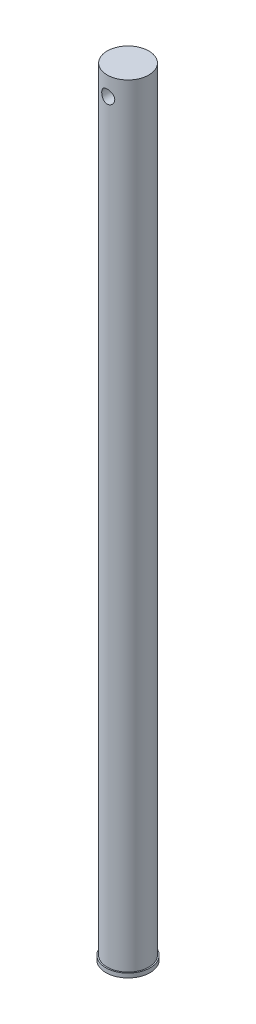
ISO-10303-21;
HEADER;
FILE_DESCRIPTION(('STEP AP214'),'2;1');
FILE_NAME('part.step','',(''),(''),'','','');
FILE_SCHEMA(('AUTOMOTIVE_DESIGN { 1 0 10303 214 1 1 1 1 }'));
ENDSEC;
DATA;
#1=APPLICATION_CONTEXT('core data for automotive mechanical design processes');
#2=APPLICATION_PROTOCOL_DEFINITION('international standard','automotive_design',2000,#1);
#3=PRODUCT_CONTEXT('',#1,'mechanical');
#4=PRODUCT('Part','Part','',(#3));
#5=PRODUCT_RELATED_PRODUCT_CATEGORY('part','',(#4));
#6=PRODUCT_DEFINITION_FORMATION('','',#4);
#7=PRODUCT_DEFINITION_CONTEXT('part definition',#1,'design');
#8=PRODUCT_DEFINITION('design','',#6,#7);
#9=PRODUCT_DEFINITION_SHAPE('','',#8);
#10=(LENGTH_UNIT() NAMED_UNIT(*) SI_UNIT(.MILLI.,.METRE.));
#11=(NAMED_UNIT(*) PLANE_ANGLE_UNIT() SI_UNIT($,.RADIAN.));
#12=(NAMED_UNIT(*) SI_UNIT($,.STERADIAN.) SOLID_ANGLE_UNIT());
#13=UNCERTAINTY_MEASURE_WITH_UNIT(LENGTH_MEASURE(1.E-05),#10,'distance_accuracy_value','');
#14=(GEOMETRIC_REPRESENTATION_CONTEXT(3) GLOBAL_UNCERTAINTY_ASSIGNED_CONTEXT((#13)) GLOBAL_UNIT_ASSIGNED_CONTEXT((#10,
#11,#12)) REPRESENTATION_CONTEXT('',''));
#15=CARTESIAN_POINT('',(0.,0.,0.));
#16=DIRECTION('',(0.,0.,1.));
#17=DIRECTION('',(1.,0.,0.));
#18=AXIS2_PLACEMENT_3D('',#15,#16,#17);
#19=CARTESIAN_POINT('',(0.,367.538,0.));
#20=DIRECTION('',(0.,-1.,0.));
#21=DIRECTION('',(0.,0.,-1.));
#22=AXIS2_PLACEMENT_3D('',#19,#20,#21);
#23=CYLINDRICAL_SURFACE('',#22,9.906);
#24=CARTESIAN_POINT('',(0.,361.748,-9.906));
#25=CARTESIAN_POINT('',(-0.169717162799785,361.747998928521,-9.90599917780914));
#26=CARTESIAN_POINT('',(-0.339445602881006,361.734016708203,-9.90159726380384));
#27=CARTESIAN_POINT('',(-0.673938184699608,361.678604361084,-9.88446847232185));
#28=CARTESIAN_POINT('',(-0.838701206873449,361.637168091857,-9.87173973185215));
#29=CARTESIAN_POINT('',(-1.15839117477005,361.528382322282,-9.8393476559066));
#30=CARTESIAN_POINT('',(-1.31333293906974,361.461072999036,-9.81969507607885));
#31=CARTESIAN_POINT('',(-1.60973071027066,361.302622942269,-9.77548399720062));
#32=CARTESIAN_POINT('',(-1.75118457571855,361.211478433041,-9.75092472103094));
#33=CARTESIAN_POINT('',(-2.02097162955031,361.004974735729,-9.69865617210438));
#34=CARTESIAN_POINT('',(-2.14882860602327,360.889010873208,-9.67087812858727));
#35=CARTESIAN_POINT('',(-2.38363432809621,360.637447701663,-9.61570072207861));
#36=CARTESIAN_POINT('',(-2.49057916723258,360.501844732203,-9.58830143072601));
#37=CARTESIAN_POINT('',(-2.68310983564701,360.210726617432,-9.53624545355769));
#38=CARTESIAN_POINT('',(-2.76810025964437,360.05480108777,-9.51167362471039));
#39=CARTESIAN_POINT('',(-2.91045450147599,359.729976892709,-9.46908926440421));
#40=CARTESIAN_POINT('',(-2.96782562015835,359.561081669404,-9.45107499983544));
#41=CARTESIAN_POINT('',(-3.05156927208296,359.220486972408,-9.42436485613363));
#42=CARTESIAN_POINT('',(-3.07882536464526,359.049026097248,-9.41540407315736));
#43=CARTESIAN_POINT('',(-3.10432565541955,358.703748980991,-9.40702901755102));
#44=CARTESIAN_POINT('',(-3.10257759151761,358.529933380465,-9.4076121987299));
#45=CARTESIAN_POINT('',(-3.07081015053398,358.19219425638,-9.41802538616976));
#46=CARTESIAN_POINT('',(-3.04191458025059,358.028151785231,-9.42748780592657));
#47=CARTESIAN_POINT('',(-2.95849469232745,357.707371184059,-9.45399605058147));
#48=CARTESIAN_POINT('',(-2.90396764388742,357.550633834288,-9.47104268349795));
#49=CARTESIAN_POINT('',(-2.77004018758997,357.24623808083,-9.51107994166389));
#50=CARTESIAN_POINT('',(-2.69028731147665,357.098746191673,-9.53415393547644));
#51=CARTESIAN_POINT('',(-2.50841687891653,356.81887035634,-9.58360792970439));
#52=CARTESIAN_POINT('',(-2.40629349907738,356.686490357701,-9.60998879018264));
#53=CARTESIAN_POINT('',(-2.17706883064353,356.434243548478,-9.66455812398114));
#54=CARTESIAN_POINT('',(-2.04903998838251,356.315224037859,-9.69277413419145));
#55=CARTESIAN_POINT('',(-1.77448919651215,356.100138240246,-9.74677237723143));
#56=CARTESIAN_POINT('',(-1.62796587032697,356.004073663368,-9.77255442864749));
#57=CARTESIAN_POINT('',(-1.31894908072523,355.837048340235,-9.81905186663502));
#58=CARTESIAN_POINT('',(-1.15633947473291,355.766290201446,-9.83972596871358));
#59=CARTESIAN_POINT('',(-0.82072791831902,355.653384030081,-9.87338004125529));
#60=CARTESIAN_POINT('',(-0.647729150269809,355.611227284593,-9.88636235473395));
#61=CARTESIAN_POINT('',(-0.30344177330455,355.558165110155,-9.90279284682759));
#62=CARTESIAN_POINT('',(-0.132346374575684,355.54611268681,-9.90659076818545));
#63=CARTESIAN_POINT('',(0.20944084011115,355.550366650584,-9.90525923243826));
#64=CARTESIAN_POINT('',(0.380132711539446,355.566668881988,-9.90013108355573));
#65=CARTESIAN_POINT('',(0.711839988772254,355.626248861863,-9.88175344716667));
#66=CARTESIAN_POINT('',(0.872990555994629,355.668843669241,-9.86870970511422));
#67=CARTESIAN_POINT('',(1.18581229079732,355.778965940508,-9.83602766555473));
#68=CARTESIAN_POINT('',(1.33748228394459,355.846496486253,-9.81638855294017));
#69=CARTESIAN_POINT('',(1.63115765498441,356.006416763732,-9.7719379374185));
#70=CARTESIAN_POINT('',(1.7728365343979,356.099373339206,-9.74701182583495));
#71=CARTESIAN_POINT('',(2.03896896423261,356.306827191617,-9.69483692523251));
#72=CARTESIAN_POINT('',(2.16341781434166,356.421330326387,-9.6675875056835));
#73=CARTESIAN_POINT('',(2.39669199999797,356.67402177774,-9.61247385111985));
#74=CARTESIAN_POINT('',(2.5046998148026,356.812970571936,-9.58462822380061));
#75=CARTESIAN_POINT('',(2.69593943471906,357.107625541636,-9.53260733471032));
#76=CARTESIAN_POINT('',(2.77917162296442,357.263331457954,-9.50843201618396));
#77=CARTESIAN_POINT('',(2.91798226854083,357.586766234941,-9.46675655616247));
#78=CARTESIAN_POINT('',(2.97366691510897,357.754446031107,-9.44923084390955));
#79=CARTESIAN_POINT('',(3.05581082196463,358.097463169225,-9.42299059899169));
#80=CARTESIAN_POINT('',(3.082281243914,358.272797560008,-9.4142727012982));
#81=CARTESIAN_POINT('',(3.10444234179799,358.617598534337,-9.4069864608542));
#82=CARTESIAN_POINT('',(3.10147447065118,358.786970615291,-9.40797575495465));
#83=CARTESIAN_POINT('',(3.0680828409094,359.122676335019,-9.41891741890776));
#84=CARTESIAN_POINT('',(3.03766036989651,359.289010115913,-9.42886936842445));
#85=CARTESIAN_POINT('',(2.95112218438558,359.611511377863,-9.45630547546242));
#86=CARTESIAN_POINT('',(2.89539137071711,359.767792486601,-9.47367657178612));
#87=CARTESIAN_POINT('',(2.76012176437793,360.068910405187,-9.51396454523457));
#88=CARTESIAN_POINT('',(2.68057811896827,360.21374487475,-9.53688255256365));
#89=CARTESIAN_POINT('',(2.49629259737634,360.494007044435,-9.58680341671116));
#90=CARTESIAN_POINT('',(2.39068484969565,360.628843078489,-9.61393122281513));
#91=CARTESIAN_POINT('',(2.15879132227147,360.879313918376,-9.66864149322035));
#92=CARTESIAN_POINT('',(2.0325000053632,360.994943565757,-9.69622407748638));
#93=CARTESIAN_POINT('',(1.75784363750034,361.207513996653,-9.74982069815159));
#94=CARTESIAN_POINT('',(1.60889072857392,361.303717941243,-9.77575368305722));
#95=CARTESIAN_POINT('',(1.29611556678029,361.469593300998,-9.82211054959393));
#96=CARTESIAN_POINT('',(1.13229914953051,361.53927507379,-9.8425365809285));
#97=CARTESIAN_POINT('',(0.808610538577713,361.645110895093,-9.87416733455605));
#98=CARTESIAN_POINT('',(0.649555710285697,361.683582905434,-9.88600074487395));
#99=CARTESIAN_POINT('',(0.327003469087308,361.735025376508,-9.90191668416884));
#100=CARTESIAN_POINT('',(0.163506968082212,361.748001032272,-9.90600079210571));
#101=CARTESIAN_POINT('',(0.,361.748,-9.906));
#102=B_SPLINE_CURVE_WITH_KNOTS('',3,(#24,#25,#26,#27,#28,#29,#30,#31,#32,#33,#34,#35,#36,#37,
#38,#39,#40,#41,#42,#43,#44,#45,#46,#47,#48,#49,#50,#51,#52,#53,#54,#55,#56,#57,#58,#59,#60,#61,
#62,#63,#64,#65,#66,#67,#68,#69,#70,#71,#72,#73,#74,#75,#76,#77,#78,#79,#80,#81,#82,#83,#84,#85,
#86,#87,#88,#89,#90,#91,#92,#93,#94,#95,#96,#97,#98,#99,#100,#101),.UNSPECIFIED.,.T.,.F.,(4,2,2,
2,2,2,2,2,2,2,2,2,2,2,2,2,2,2,2,2,2,2,2,2,2,2,2,2,2,2,2,2,2,2,2,2,2,2,4),(0.,0.508550475560675,
1.01721477001258,1.5250923528379,2.03305043682327,2.55518141955897,3.07740984528613,
3.61258809604515,4.14762480075796,4.66650870588334,5.18525418257435,5.68342955582766,
6.18165801715831,6.68718073654229,7.19283520811967,7.72157698449076,8.25035813924252,
8.78328272787472,9.31604489740507,9.82817572821973,10.3402315064463,10.839516030322,
11.3388622824106,11.8504038053384,12.3620846018047,12.8941016834876,13.4261105375612,
13.9560523257757,14.4857915728997,14.9915065645921,15.497197840196,15.9954433547896,
16.4937904744019,17.0116814955932,17.5297113878594,18.0647217207769,18.5995229027869,
19.0895646453484,19.5795065286792),.UNSPECIFIED.);
#103=CARTESIAN_POINT('',(0.,361.748,-9.906));
#104=VERTEX_POINT('',#103);
#105=EDGE_CURVE('E36',#104,#104,#102,.T.);
#106=ORIENTED_EDGE('',*,*,#105,.T.);
#107=EDGE_LOOP('',(#106));
#108=FACE_BOUND('',#107,.T.);
#109=CARTESIAN_POINT('',(3.09999999999999,358.648,9.40844492995522));
#110=CARTESIAN_POINT('',(3.09999889052878,358.478512649003,9.40844594629458));
#111=CARTESIAN_POINT('',(3.08605315405969,358.309013986756,9.413074851886));
#112=CARTESIAN_POINT('',(3.03079885916146,357.974997151281,9.43100818327891));
#113=CARTESIAN_POINT('',(2.98948296796968,357.810480325095,9.44431493395474));
#114=CARTESIAN_POINT('',(2.88104876358965,357.491313756269,9.47795240643352));
#115=CARTESIAN_POINT('',(2.81397620809861,357.336647079344,9.49827066557167));
#116=CARTESIAN_POINT('',(2.65608537410762,357.04071860095,9.54362446814132));
#117=CARTESIAN_POINT('',(2.56526287818102,356.899459186371,9.56866084917869));
#118=CARTESIAN_POINT('',(2.35909954896564,356.629488671875,9.62159729631544));
#119=CARTESIAN_POINT('',(2.2430814293739,356.501307408258,9.64956238795848));
#120=CARTESIAN_POINT('',(1.99126936719257,356.265865664927,9.70465207107307));
#121=CARTESIAN_POINT('',(1.85547265975446,356.15860811505,9.73177654439061));
#122=CARTESIAN_POINT('',(1.56414935026077,355.965719032576,9.78287279171415));
#123=CARTESIAN_POINT('',(1.40824502488887,355.880633346134,9.80675907760499));
#124=CARTESIAN_POINT('',(1.08346419328968,355.738097488024,9.84792812930078));
#125=CARTESIAN_POINT('',(0.914590756117409,355.680640801362,9.86521245166899));
#126=CARTESIAN_POINT('',(0.574213196546782,355.596763583688,9.89076983177562));
#127=CARTESIAN_POINT('',(0.402952301431719,355.569437430651,9.89930525773119));
#128=CARTESIAN_POINT('',(0.0580779813902911,355.543727371389,9.90732987018807));
#129=CARTESIAN_POINT('',(-0.115534898275763,355.545336867983,9.90682111871642));
#130=CARTESIAN_POINT('',(-0.453810324719841,355.576857108525,9.89699728375633));
#131=CARTESIAN_POINT('',(-0.618574642999552,355.605786076151,9.88798770331893));
#132=CARTESIAN_POINT('',(-0.940780072890124,355.689512892221,9.86255043808704));
#133=CARTESIAN_POINT('',(-1.09822070571038,355.744312429367,9.84612226904726));
#134=CARTESIAN_POINT('',(-1.40357238805535,355.878854449621,9.8072840360243));
#135=CARTESIAN_POINT('',(-1.5513429467276,355.958894485245,9.78480310593874));
#136=CARTESIAN_POINT('',(-1.83166059809276,356.141406618206,9.73622737490145));
#137=CARTESIAN_POINT('',(-1.96420381981552,356.24388440033,9.71013165873054));
#138=CARTESIAN_POINT('',(-2.21615822096116,356.473401650207,9.6558164588839));
#139=CARTESIAN_POINT('',(-2.33478921891057,356.601288529926,9.62755379643933));
#140=CARTESIAN_POINT('',(-2.54915377127928,356.875405136561,9.57303069668153));
#141=CARTESIAN_POINT('',(-2.64488461277116,357.021637033643,9.5467704968461));
#142=CARTESIAN_POINT('',(-2.81164262012195,357.330502556123,9.49900741424247));
#143=CARTESIAN_POINT('',(-2.88238000965628,357.493302068515,9.47756132387884));
#144=CARTESIAN_POINT('',(-2.99519081690978,357.829335015855,9.44252073589027));
#145=CARTESIAN_POINT('',(-3.03727456787157,358.002564664869,9.42892340806826));
#146=CARTESIAN_POINT('',(-3.09007660987781,358.347064111396,9.41174835324044));
#147=CARTESIAN_POINT('',(-3.10198991141381,358.518131837638,9.40778913325687));
#148=CARTESIAN_POINT('',(-3.09746825734678,358.859834111294,9.40927924660996));
#149=CARTESIAN_POINT('',(-3.08103769723874,359.030468721765,9.41472712111812));
#150=CARTESIAN_POINT('',(-3.02136281103057,359.361310252523,9.43404086805172));
#151=CARTESIAN_POINT('',(-2.9789105802225,359.521676084978,9.4476578236185));
#152=CARTESIAN_POINT('',(-2.8693278239122,359.832990369841,9.48151150827996));
#153=CARTESIAN_POINT('',(-2.80219326591974,359.983937278712,9.50174931900133));
#154=CARTESIAN_POINT('',(-2.64294963471786,360.276930559457,9.54728653051085));
#155=CARTESIAN_POINT('',(-2.55017817905427,360.418596393684,9.57271469762291));
#156=CARTESIAN_POINT('',(-2.34306701113802,360.684784794988,9.62550124813057));
#157=CARTESIAN_POINT('',(-2.2287216802669,360.809302881524,9.65286013319055));
#158=CARTESIAN_POINT('',(-1.97605333066839,361.043002133028,9.70780194685249));
#159=CARTESIAN_POINT('',(-1.83693102806775,361.151330340391,9.73534689293917));
#160=CARTESIAN_POINT('',(-1.5418164000877,361.343137300903,9.78642069667665));
#161=CARTESIAN_POINT('',(-1.38582484507855,361.42661718815,9.80994973759587));
#162=CARTESIAN_POINT('',(-1.0623570894053,361.565557586632,9.8502066984653));
#163=CARTESIAN_POINT('',(-0.894974294888868,361.621220632323,9.86698360102458));
#164=CARTESIAN_POINT('',(-0.552605174122446,361.703420482801,9.8920613585434));
#165=CARTESIAN_POINT('',(-0.377621252607967,361.729966430468,9.90036487412204));
#166=CARTESIAN_POINT('',(-0.0328676101127206,361.752434156943,9.90738348897342));
#167=CARTESIAN_POINT('',(0.136814923660559,361.749587837008,9.90648431004359));
#168=CARTESIAN_POINT('',(0.473174918837302,361.716332129456,9.89612300296258));
#169=CARTESIAN_POINT('',(0.639852576383446,361.685924547586,9.88666143579872));
#170=CARTESIAN_POINT('',(0.963411659231982,361.599194583944,9.86036090295072));
#171=CARTESIAN_POINT('',(1.12038990133997,361.543202822637,9.84361618523123));
#172=CARTESIAN_POINT('',(1.42279928653792,361.407192702889,9.80447615901159));
#173=CARTESIAN_POINT('',(1.56822844095729,361.327170217823,9.7820798801146));
#174=CARTESIAN_POINT('',(1.84878953226194,361.142225161518,9.73302596045813));
#175=CARTESIAN_POINT('',(1.98340354878734,361.036548783672,9.70624936435452));
#176=CARTESIAN_POINT('',(2.23339646422936,360.80462422267,9.6517965512273));
#177=CARTESIAN_POINT('',(2.34876957908856,360.678369875988,9.62412006666294));
#178=CARTESIAN_POINT('',(2.56087759615326,360.403841462769,9.56990825001818));
#179=CARTESIAN_POINT('',(2.65686516120167,360.254974789274,9.54344146663922));
#180=CARTESIAN_POINT('',(2.82235629991737,359.942426975596,9.49581997395171));
#181=CARTESIAN_POINT('',(2.89187051050082,359.778751818202,9.47466313229172));
#182=CARTESIAN_POINT('',(2.9974111452724,359.455439331853,9.44177753886595));
#183=CARTESIAN_POINT('',(3.03576870409443,359.296627062409,9.42940378021031));
#184=CARTESIAN_POINT('',(3.08706051138345,358.974545950442,9.41273798896532));
#185=CARTESIAN_POINT('',(3.10000106882599,358.811278224052,9.4084439508492));
#186=CARTESIAN_POINT('',(3.09999999999999,358.648,9.40844492995522));
#187=B_SPLINE_CURVE_WITH_KNOTS('',3,(#109,#110,#111,#112,#113,#114,#115,#116,#117,#118,#119,
#120,#121,#122,#123,#124,#125,#126,#127,#128,#129,#130,#131,#132,#133,#134,#135,#136,#137,#138,
#139,#140,#141,#142,#143,#144,#145,#146,#147,#148,#149,#150,#151,#152,#153,#154,#155,#156,#157,
#158,#159,#160,#161,#162,#163,#164,#165,#166,#167,#168,#169,#170,#171,#172,#173,#174,#175,#176,
#177,#178,#179,#180,#181,#182,#183,#184,#185,#186),.UNSPECIFIED.,.T.,.F.,(4,2,2,2,2,2,2,2,2,2,2,
2,2,2,2,2,2,2,2,2,2,2,2,2,2,2,2,2,2,2,2,2,2,2,2,2,2,2,4),(0.,0.50785888032799,1.01585387663794,
1.52295054459032,2.03013732211628,2.55316782144827,3.07627150550557,3.61124306484487,
4.1460884144837,4.66437853110558,5.18255048169877,5.68278226002893,6.18304669550126,
6.68944413524563,7.1959700237164,7.72366194270671,8.25141634518616,8.78510295486944,
9.31859700128562,9.83060401012894,10.342531625347,10.8396008402273,11.3367513002065,
11.8481914465745,12.3597649748018,12.8926091237186,13.4254289494427,13.9543106343076,
14.4830262007008,14.9896750864258,15.496290780123,15.9965370444811,16.496869261743,
17.0142053096812,17.531696596114,18.0663957344074,18.600879804918,19.0902548889058,
19.579508485478),.UNSPECIFIED.);
#188=CARTESIAN_POINT('',(3.09999999999999,358.648,9.40844492995522));
#189=VERTEX_POINT('',#188);
#190=EDGE_CURVE('E48',#189,#189,#187,.T.);
#191=ORIENTED_EDGE('',*,*,#190,.T.);
#192=EDGE_LOOP('',(#191));
#193=FACE_BOUND('',#192,.T.);
#194=CARTESIAN_POINT('',(0.,367.538,0.));
#195=DIRECTION('',(0.,1.,0.));
#196=DIRECTION('',(0.,0.,1.));
#197=AXIS2_PLACEMENT_3D('',#194,#195,#196);
#198=CIRCLE('',#197,9.906);
#199=CARTESIAN_POINT('',(0.,367.538,9.906));
#200=VERTEX_POINT('',#199);
#201=EDGE_CURVE('E10',#200,#200,#198,.T.);
#202=ORIENTED_EDGE('',*,*,#201,.F.);
#203=EDGE_LOOP('',(#202));
#204=FACE_BOUND('',#203,.T.);
#205=CARTESIAN_POINT('',(0.,0.,0.));
#206=DIRECTION('',(0.,-1.,0.));
#207=DIRECTION('',(0.,0.,-1.));
#208=AXIS2_PLACEMENT_3D('',#205,#206,#207);
#209=CIRCLE('',#208,9.906);
#210=CARTESIAN_POINT('',(0.,0.,-9.906));
#211=VERTEX_POINT('',#210);
#212=EDGE_CURVE('E50',#211,#211,#209,.T.);
#213=ORIENTED_EDGE('',*,*,#212,.F.);
#214=EDGE_LOOP('',(#213));
#215=FACE_BOUND('',#214,.T.);
#216=ADVANCED_FACE('F32',(#108,#193,#204,#215),#23,.T.);
#217=CARTESIAN_POINT('',(0.,367.538,0.));
#218=DIRECTION('',(0.,1.,0.));
#219=DIRECTION('',(0.,0.,1.));
#220=AXIS2_PLACEMENT_3D('',#217,#218,#219);
#221=PLANE('',#220);
#222=ORIENTED_EDGE('',*,*,#201,.T.);
#223=EDGE_LOOP('',(#222));
#224=FACE_BOUND('',#223,.T.);
#225=ADVANCED_FACE('F61',(#224),#221,.T.);
#226=CARTESIAN_POINT('',(0.,358.648,-10.));
#227=DIRECTION('',(0.,0.,1.));
#228=DIRECTION('',(1.,0.,0.));
#229=AXIS2_PLACEMENT_3D('',#226,#227,#228);
#230=CYLINDRICAL_SURFACE('',#229,3.09999999999999);
#231=ORIENTED_EDGE('',*,*,#190,.F.);
#232=EDGE_LOOP('',(#231));
#233=FACE_BOUND('',#232,.T.);
#234=ORIENTED_EDGE('',*,*,#105,.F.);
#235=EDGE_LOOP('',(#234));
#236=FACE_BOUND('',#235,.T.);
#237=ADVANCED_FACE('F56',(#233,#236),#230,.F.);
#238=CARTESIAN_POINT('',(0.,-2.,0.));
#239=DIRECTION('',(0.,1.,0.));
#240=DIRECTION('',(0.,0.,1.));
#241=AXIS2_PLACEMENT_3D('',#238,#239,#240);
#242=CYLINDRICAL_SURFACE('',#241,10.5);
#243=CARTESIAN_POINT('',(0.,-2.,0.));
#244=DIRECTION('',(0.,-1.,0.));
#245=DIRECTION('',(0.,0.,-1.));
#246=AXIS2_PLACEMENT_3D('',#243,#244,#245);
#247=CIRCLE('',#246,10.5);
#248=CARTESIAN_POINT('',(0.,-2.,-10.5));
#249=VERTEX_POINT('',#248);
#250=EDGE_CURVE('E80',#249,#249,#247,.T.);
#251=ORIENTED_EDGE('',*,*,#250,.F.);
#252=EDGE_LOOP('',(#251));
#253=FACE_BOUND('',#252,.T.);
#254=CARTESIAN_POINT('',(0.,0.,0.));
#255=DIRECTION('',(0.,-1.,0.));
#256=DIRECTION('',(0.,0.,-1.));
#257=AXIS2_PLACEMENT_3D('',#254,#255,#256);
#258=CIRCLE('',#257,10.5);
#259=CARTESIAN_POINT('',(0.,0.,-10.5));
#260=VERTEX_POINT('',#259);
#261=EDGE_CURVE('E82',#260,#260,#258,.T.);
#262=ORIENTED_EDGE('',*,*,#261,.T.);
#263=EDGE_LOOP('',(#262));
#264=FACE_BOUND('',#263,.T.);
#265=ADVANCED_FACE('F60',(#253,#264),#242,.T.);
#266=CARTESIAN_POINT('',(0.,-2.,0.));
#267=DIRECTION('',(0.,-1.,0.));
#268=DIRECTION('',(0.,0.,-1.));
#269=AXIS2_PLACEMENT_3D('',#266,#267,#268);
#270=PLANE('',#269);
#271=ORIENTED_EDGE('',*,*,#250,.T.);
#272=EDGE_LOOP('',(#271));
#273=FACE_BOUND('',#272,.T.);
#274=ADVANCED_FACE('F92',(#273),#270,.T.);
#275=CARTESIAN_POINT('',(0.,0.,0.));
#276=DIRECTION('',(0.,-1.,0.));
#277=DIRECTION('',(0.,0.,-1.));
#278=AXIS2_PLACEMENT_3D('',#275,#276,#277);
#279=PLANE('',#278);
#280=ORIENTED_EDGE('',*,*,#212,.T.);
#281=EDGE_LOOP('',(#280));
#282=FACE_BOUND('',#281,.T.);
#283=ORIENTED_EDGE('',*,*,#261,.F.);
#284=EDGE_LOOP('',(#283));
#285=FACE_BOUND('',#284,.T.);
#286=ADVANCED_FACE('F90',(#282,#285),#279,.F.);
#287=CLOSED_SHELL('',(#216,#225,#237,#265,#274,#286));
#288=MANIFOLD_SOLID_BREP('B2',#287);
#289=ADVANCED_BREP_SHAPE_REPRESENTATION('',(#18,#288),#14);
#290=SHAPE_DEFINITION_REPRESENTATION(#9,#289);
ENDSEC;
END-ISO-10303-21;
